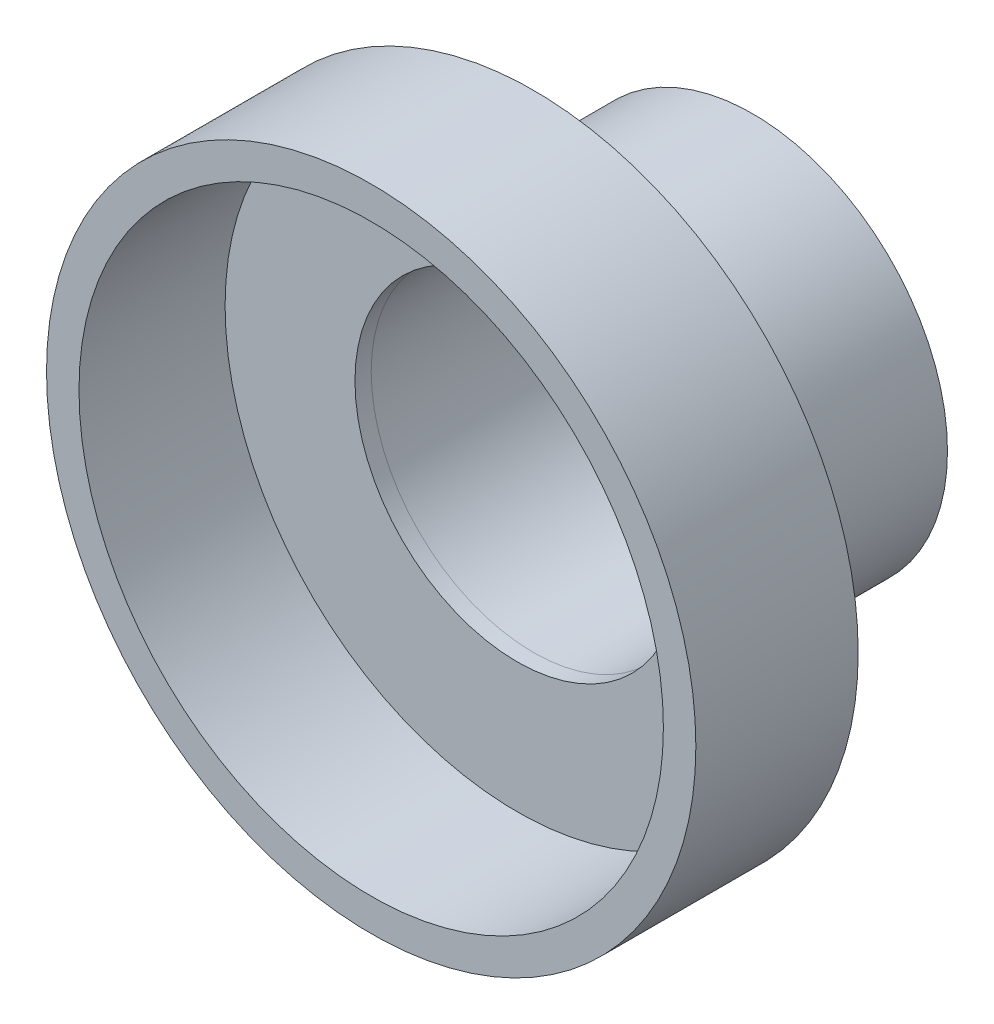
ISO-10303-21;
HEADER;
FILE_DESCRIPTION(('STEP AP214'),'2;1');
FILE_NAME('part.step','',(''),(''),'','','');
FILE_SCHEMA(('AUTOMOTIVE_DESIGN { 1 0 10303 214 1 1 1 1 }'));
ENDSEC;
DATA;
#1=APPLICATION_CONTEXT('core data for automotive mechanical design processes');
#2=APPLICATION_PROTOCOL_DEFINITION('international standard','automotive_design',2000,#1);
#3=PRODUCT_CONTEXT('',#1,'mechanical');
#4=PRODUCT('Part','Part','',(#3));
#5=PRODUCT_RELATED_PRODUCT_CATEGORY('part','',(#4));
#6=PRODUCT_DEFINITION_FORMATION('','',#4);
#7=PRODUCT_DEFINITION_CONTEXT('part definition',#1,'design');
#8=PRODUCT_DEFINITION('design','',#6,#7);
#9=PRODUCT_DEFINITION_SHAPE('','',#8);
#10=(LENGTH_UNIT() NAMED_UNIT(*) SI_UNIT(.MILLI.,.METRE.));
#11=(NAMED_UNIT(*) PLANE_ANGLE_UNIT() SI_UNIT($,.RADIAN.));
#12=(NAMED_UNIT(*) SI_UNIT($,.STERADIAN.) SOLID_ANGLE_UNIT());
#13=UNCERTAINTY_MEASURE_WITH_UNIT(LENGTH_MEASURE(1.E-05),#10,'distance_accuracy_value','');
#14=(GEOMETRIC_REPRESENTATION_CONTEXT(3) GLOBAL_UNCERTAINTY_ASSIGNED_CONTEXT((#13)) GLOBAL_UNIT_ASSIGNED_CONTEXT((#10,
#11,#12)) REPRESENTATION_CONTEXT('',''));
#15=CARTESIAN_POINT('',(0.,0.,0.));
#16=DIRECTION('',(0.,0.,1.));
#17=DIRECTION('',(1.,0.,0.));
#18=AXIS2_PLACEMENT_3D('',#15,#16,#17);
#19=CARTESIAN_POINT('',(0.,0.,5.875));
#20=DIRECTION('',(0.,0.,1.));
#21=DIRECTION('',(1.,0.,0.));
#22=AXIS2_PLACEMENT_3D('',#19,#20,#21);
#23=PLANE('',#22);
#24=CARTESIAN_POINT('',(0.,0.,5.875));
#25=DIRECTION('',(0.,0.,1.));
#26=DIRECTION('',(1.,0.,0.));
#27=AXIS2_PLACEMENT_3D('',#24,#25,#26);
#28=CIRCLE('',#27,5.);
#29=CARTESIAN_POINT('',(5.,0.,5.875));
#30=VERTEX_POINT('',#29);
#31=EDGE_CURVE('E53',#30,#30,#28,.T.);
#32=ORIENTED_EDGE('',*,*,#31,.T.);
#33=EDGE_LOOP('',(#32));
#34=FACE_BOUND('',#33,.T.);
#35=CARTESIAN_POINT('',(0.,0.,5.875));
#36=DIRECTION('',(0.,0.,1.));
#37=DIRECTION('',(1.,0.,0.));
#38=AXIS2_PLACEMENT_3D('',#35,#36,#37);
#39=CIRCLE('',#38,4.5);
#40=CARTESIAN_POINT('',(4.5,0.,5.875));
#41=VERTEX_POINT('',#40);
#42=EDGE_CURVE('E64',#41,#41,#39,.T.);
#43=ORIENTED_EDGE('',*,*,#42,.F.);
#44=EDGE_LOOP('',(#43));
#45=FACE_BOUND('',#44,.T.);
#46=ADVANCED_FACE('F45',(#34,#45),#23,.T.);
#47=CARTESIAN_POINT('',(0.,0.,3.375));
#48=DIRECTION('',(0.,0.,1.));
#49=DIRECTION('',(1.,0.,0.));
#50=AXIS2_PLACEMENT_3D('',#47,#48,#49);
#51=PLANE('',#50);
#52=CARTESIAN_POINT('',(0.,0.,3.375));
#53=DIRECTION('',(0.,0.,1.));
#54=DIRECTION('',(1.,0.,0.));
#55=AXIS2_PLACEMENT_3D('',#52,#53,#54);
#56=CIRCLE('',#55,5.);
#57=CARTESIAN_POINT('',(5.,0.,3.375));
#58=VERTEX_POINT('',#57);
#59=EDGE_CURVE('E58',#58,#58,#56,.T.);
#60=ORIENTED_EDGE('',*,*,#59,.F.);
#61=EDGE_LOOP('',(#60));
#62=FACE_BOUND('',#61,.T.);
#63=CARTESIAN_POINT('',(0.,0.,3.375));
#64=DIRECTION('',(0.,0.,1.));
#65=DIRECTION('',(1.,0.,0.));
#66=AXIS2_PLACEMENT_3D('',#63,#64,#65);
#67=CIRCLE('',#66,2.5);
#68=CARTESIAN_POINT('',(2.5,0.,3.375));
#69=VERTEX_POINT('',#68);
#70=EDGE_CURVE('E70',#69,#69,#67,.T.);
#71=ORIENTED_EDGE('',*,*,#70,.T.);
#72=EDGE_LOOP('',(#71));
#73=FACE_BOUND('',#72,.T.);
#74=ADVANCED_FACE('F93',(#62,#73),#51,.F.);
#75=CARTESIAN_POINT('',(0.,0.,5.875));
#76=DIRECTION('',(0.,0.,-1.));
#77=DIRECTION('',(-1.,0.,0.));
#78=AXIS2_PLACEMENT_3D('',#75,#76,#77);
#79=CYLINDRICAL_SURFACE('',#78,5.);
#80=ORIENTED_EDGE('',*,*,#31,.F.);
#81=EDGE_LOOP('',(#80));
#82=FACE_BOUND('',#81,.T.);
#83=ORIENTED_EDGE('',*,*,#59,.T.);
#84=EDGE_LOOP('',(#83));
#85=FACE_BOUND('',#84,.T.);
#86=ADVANCED_FACE('F47',(#82,#85),#79,.T.);
#87=CARTESIAN_POINT('',(0.,0.,5.875));
#88=DIRECTION('',(0.,0.,-1.));
#89=DIRECTION('',(-1.,0.,0.));
#90=AXIS2_PLACEMENT_3D('',#87,#88,#89);
#91=CYLINDRICAL_SURFACE('',#90,4.5);
#92=CARTESIAN_POINT('',(0.,0.,3.625));
#93=DIRECTION('',(0.,0.,1.));
#94=DIRECTION('',(1.,0.,0.));
#95=AXIS2_PLACEMENT_3D('',#92,#93,#94);
#96=CIRCLE('',#95,4.5);
#97=CARTESIAN_POINT('',(4.5,0.,3.625));
#98=VERTEX_POINT('',#97);
#99=EDGE_CURVE('E11',#98,#98,#96,.T.);
#100=ORIENTED_EDGE('',*,*,#99,.F.);
#101=EDGE_LOOP('',(#100));
#102=FACE_BOUND('',#101,.T.);
#103=ORIENTED_EDGE('',*,*,#42,.T.);
#104=EDGE_LOOP('',(#103));
#105=FACE_BOUND('',#104,.T.);
#106=ADVANCED_FACE('F83',(#102,#105),#91,.F.);
#107=CARTESIAN_POINT('',(0.,0.,3.625));
#108=DIRECTION('',(0.,0.,1.));
#109=DIRECTION('',(1.,0.,0.));
#110=AXIS2_PLACEMENT_3D('',#107,#108,#109);
#111=PLANE('',#110);
#112=ORIENTED_EDGE('',*,*,#99,.T.);
#113=EDGE_LOOP('',(#112));
#114=FACE_BOUND('',#113,.T.);
#115=CARTESIAN_POINT('',(0.,0.,3.625));
#116=DIRECTION('',(0.,0.,1.));
#117=DIRECTION('',(1.,0.,0.));
#118=AXIS2_PLACEMENT_3D('',#115,#116,#117);
#119=CIRCLE('',#118,2.5);
#120=CARTESIAN_POINT('',(2.5,0.,3.625));
#121=VERTEX_POINT('',#120);
#122=EDGE_CURVE('E69',#121,#121,#119,.T.);
#123=ORIENTED_EDGE('',*,*,#122,.F.);
#124=EDGE_LOOP('',(#123));
#125=FACE_BOUND('',#124,.T.);
#126=ADVANCED_FACE('F81',(#114,#125),#111,.T.);
#127=CARTESIAN_POINT('',(0.,0.,3.625));
#128=DIRECTION('',(0.,0.,-1.));
#129=DIRECTION('',(-1.,0.,0.));
#130=AXIS2_PLACEMENT_3D('',#127,#128,#129);
#131=CYLINDRICAL_SURFACE('',#130,2.5);
#132=ORIENTED_EDGE('',*,*,#122,.T.);
#133=EDGE_LOOP('',(#132));
#134=FACE_BOUND('',#133,.T.);
#135=ORIENTED_EDGE('',*,*,#70,.F.);
#136=EDGE_LOOP('',(#135));
#137=FACE_BOUND('',#136,.T.);
#138=ADVANCED_FACE('F78',(#134,#137),#131,.F.);
#139=CLOSED_SHELL('',(#46,#74,#86,#106,#126,#138));
#140=MANIFOLD_SOLID_BREP('B2',#139);
#141=CARTESIAN_POINT('',(0.,0.,3.375));
#142=DIRECTION('',(0.,0.,1.));
#143=DIRECTION('',(1.,0.,0.));
#144=AXIS2_PLACEMENT_3D('',#141,#142,#143);
#145=PLANE('',#144);
#146=CARTESIAN_POINT('',(0.,0.,3.375));
#147=DIRECTION('',(0.,0.,1.));
#148=DIRECTION('',(1.,0.,0.));
#149=AXIS2_PLACEMENT_3D('',#146,#147,#148);
#150=CIRCLE('',#149,3.);
#151=CARTESIAN_POINT('',(3.,0.,3.375));
#152=VERTEX_POINT('',#151);
#153=EDGE_CURVE('E44',#152,#152,#150,.T.);
#154=ORIENTED_EDGE('',*,*,#153,.T.);
#155=EDGE_LOOP('',(#154));
#156=FACE_BOUND('',#155,.T.);
#157=CARTESIAN_POINT('',(0.,0.,3.375));
#158=DIRECTION('',(0.,0.,1.));
#159=DIRECTION('',(1.,0.,0.));
#160=AXIS2_PLACEMENT_3D('',#157,#158,#159);
#161=CIRCLE('',#160,2.5);
#162=CARTESIAN_POINT('',(2.5,0.,3.375));
#163=VERTEX_POINT('',#162);
#164=EDGE_CURVE('E157',#163,#163,#161,.T.);
#165=ORIENTED_EDGE('',*,*,#164,.F.);
#166=EDGE_LOOP('',(#165));
#167=FACE_BOUND('',#166,.T.);
#168=ADVANCED_FACE('F146',(#156,#167),#145,.T.);
#169=CARTESIAN_POINT('',(0.,0.,0.));
#170=DIRECTION('',(0.,0.,1.));
#171=DIRECTION('',(1.,0.,0.));
#172=AXIS2_PLACEMENT_3D('',#169,#170,#171);
#173=PLANE('',#172);
#174=CARTESIAN_POINT('',(0.,0.,0.));
#175=DIRECTION('',(0.,0.,1.));
#176=DIRECTION('',(1.,0.,0.));
#177=AXIS2_PLACEMENT_3D('',#174,#175,#176);
#178=CIRCLE('',#177,3.);
#179=CARTESIAN_POINT('',(3.,0.,0.));
#180=VERTEX_POINT('',#179);
#181=EDGE_CURVE('E150',#180,#180,#178,.T.);
#182=ORIENTED_EDGE('',*,*,#181,.F.);
#183=EDGE_LOOP('',(#182));
#184=FACE_BOUND('',#183,.T.);
#185=CARTESIAN_POINT('',(0.,0.,0.));
#186=DIRECTION('',(0.,0.,1.));
#187=DIRECTION('',(1.,0.,0.));
#188=AXIS2_PLACEMENT_3D('',#185,#186,#187);
#189=CIRCLE('',#188,2.5);
#190=CARTESIAN_POINT('',(2.5,0.,0.));
#191=VERTEX_POINT('',#190);
#192=EDGE_CURVE('E159',#191,#191,#189,.T.);
#193=ORIENTED_EDGE('',*,*,#192,.T.);
#194=EDGE_LOOP('',(#193));
#195=FACE_BOUND('',#194,.T.);
#196=ADVANCED_FACE('F169',(#184,#195),#173,.F.);
#197=CARTESIAN_POINT('',(0.,0.,3.375));
#198=DIRECTION('',(0.,0.,-1.));
#199=DIRECTION('',(-1.,0.,0.));
#200=AXIS2_PLACEMENT_3D('',#197,#198,#199);
#201=CYLINDRICAL_SURFACE('',#200,3.);
#202=ORIENTED_EDGE('',*,*,#153,.F.);
#203=EDGE_LOOP('',(#202));
#204=FACE_BOUND('',#203,.T.);
#205=ORIENTED_EDGE('',*,*,#181,.T.);
#206=EDGE_LOOP('',(#205));
#207=FACE_BOUND('',#206,.T.);
#208=ADVANCED_FACE('F148',(#204,#207),#201,.T.);
#209=CARTESIAN_POINT('',(0.,0.,3.375));
#210=DIRECTION('',(0.,0.,-1.));
#211=DIRECTION('',(-1.,0.,0.));
#212=AXIS2_PLACEMENT_3D('',#209,#210,#211);
#213=CYLINDRICAL_SURFACE('',#212,2.5);
#214=ORIENTED_EDGE('',*,*,#164,.T.);
#215=EDGE_LOOP('',(#214));
#216=FACE_BOUND('',#215,.T.);
#217=ORIENTED_EDGE('',*,*,#192,.F.);
#218=EDGE_LOOP('',(#217));
#219=FACE_BOUND('',#218,.T.);
#220=ADVANCED_FACE('F165',(#216,#219),#213,.F.);
#221=CLOSED_SHELL('',(#168,#196,#208,#220));
#222=MANIFOLD_SOLID_BREP('B6',#221);
#223=ADVANCED_BREP_SHAPE_REPRESENTATION('',(#18,#140,#222),#14);
#224=SHAPE_DEFINITION_REPRESENTATION(#9,#223);
ENDSEC;
END-ISO-10303-21;
